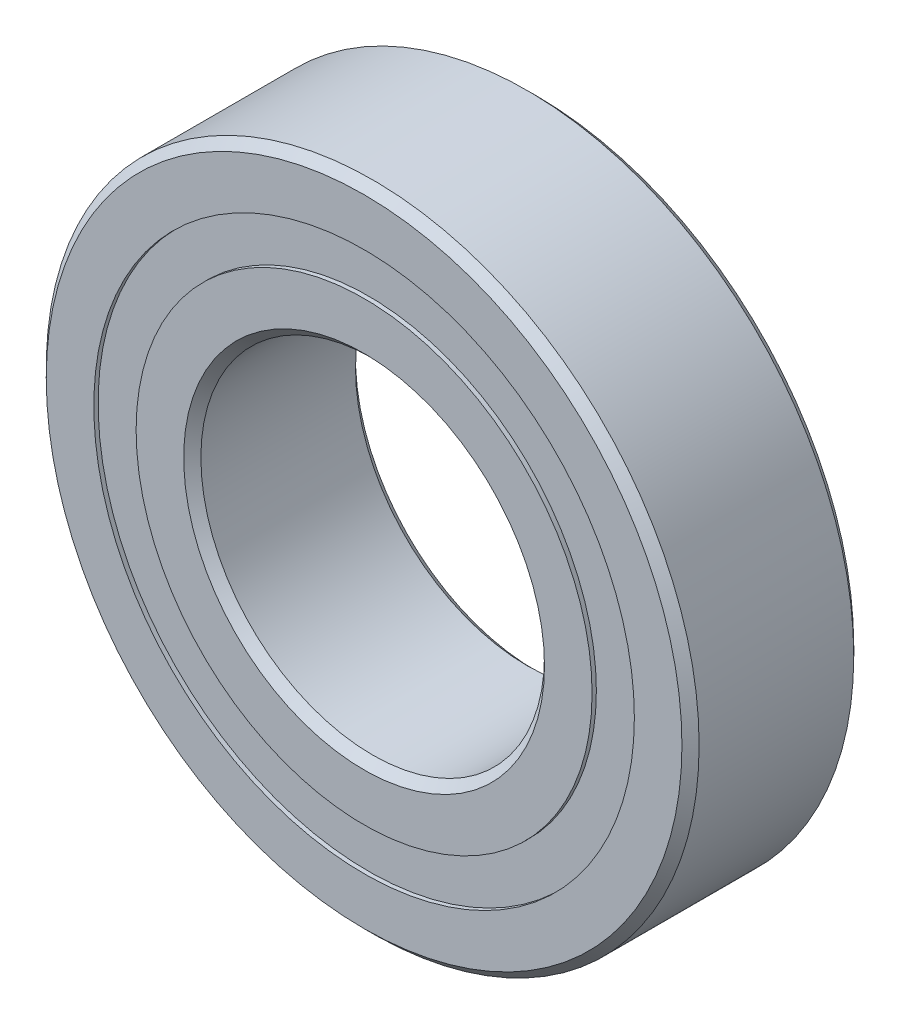
ISO-10303-21;
HEADER;
FILE_DESCRIPTION(('STEP AP214'),'2;1');
FILE_NAME('part.step','',(''),(''),'','','');
FILE_SCHEMA(('AUTOMOTIVE_DESIGN { 1 0 10303 214 1 1 1 1 }'));
ENDSEC;
DATA;
#1=APPLICATION_CONTEXT('core data for automotive mechanical design processes');
#2=APPLICATION_PROTOCOL_DEFINITION('international standard','automotive_design',2000,#1);
#3=PRODUCT_CONTEXT('',#1,'mechanical');
#4=PRODUCT('Part','Part','',(#3));
#5=PRODUCT_RELATED_PRODUCT_CATEGORY('part','',(#4));
#6=PRODUCT_DEFINITION_FORMATION('','',#4);
#7=PRODUCT_DEFINITION_CONTEXT('part definition',#1,'design');
#8=PRODUCT_DEFINITION('design','',#6,#7);
#9=PRODUCT_DEFINITION_SHAPE('','',#8);
#10=(LENGTH_UNIT() NAMED_UNIT(*) SI_UNIT(.MILLI.,.METRE.));
#11=(NAMED_UNIT(*) PLANE_ANGLE_UNIT() SI_UNIT($,.RADIAN.));
#12=(NAMED_UNIT(*) SI_UNIT($,.STERADIAN.) SOLID_ANGLE_UNIT());
#13=UNCERTAINTY_MEASURE_WITH_UNIT(LENGTH_MEASURE(1.E-05),#10,'distance_accuracy_value','');
#14=(GEOMETRIC_REPRESENTATION_CONTEXT(3) GLOBAL_UNCERTAINTY_ASSIGNED_CONTEXT((#13)) GLOBAL_UNIT_ASSIGNED_CONTEXT((#10,
#11,#12)) REPRESENTATION_CONTEXT('',''));
#15=CARTESIAN_POINT('',(0.,0.,0.));
#16=DIRECTION('',(0.,0.,1.));
#17=DIRECTION('',(1.,0.,0.));
#18=AXIS2_PLACEMENT_3D('',#15,#16,#17);
#19=CARTESIAN_POINT('',(0.,7.86538461538461,-2.375));
#20=DIRECTION('',(0.,0.,1.));
#21=DIRECTION('',(1.,0.,0.));
#22=AXIS2_PLACEMENT_3D('',#19,#20,#21);
#23=PLANE('',#22);
#24=CARTESIAN_POINT('',(0.,0.,-2.375));
#25=DIRECTION('',(0.,0.,1.));
#26=DIRECTION('',(1.,0.,0.));
#27=AXIS2_PLACEMENT_3D('',#24,#25,#26);
#28=CIRCLE('',#27,7.86538461538461);
#29=CARTESIAN_POINT('',(7.86538461538461,0.,-2.375));
#30=VERTEX_POINT('',#29);
#31=EDGE_CURVE('E55',#30,#30,#28,.T.);
#32=ORIENTED_EDGE('',*,*,#31,.F.);
#33=EDGE_LOOP('',(#32));
#34=FACE_BOUND('',#33,.T.);
#35=CARTESIAN_POINT('',(0.,0.,-2.375));
#36=DIRECTION('',(0.,0.,1.));
#37=DIRECTION('',(1.,0.,0.));
#38=AXIS2_PLACEMENT_3D('',#35,#36,#37);
#39=CIRCLE('',#38,6.63461538461539);
#40=CARTESIAN_POINT('',(6.63461538461539,0.,-2.375));
#41=VERTEX_POINT('',#40);
#42=EDGE_CURVE('E11',#41,#41,#39,.T.);
#43=ORIENTED_EDGE('',*,*,#42,.T.);
#44=EDGE_LOOP('',(#43));
#45=FACE_BOUND('',#44,.T.);
#46=ADVANCED_FACE('F41',(#34,#45),#23,.F.);
#47=CARTESIAN_POINT('',(0.,0.,2.5));
#48=DIRECTION('',(0.,0.,1.));
#49=DIRECTION('',(1.,0.,0.));
#50=AXIS2_PLACEMENT_3D('',#47,#48,#49);
#51=CYLINDRICAL_SURFACE('',#50,6.63461538461539);
#52=ORIENTED_EDGE('',*,*,#42,.F.);
#53=EDGE_LOOP('',(#52));
#54=FACE_BOUND('',#53,.T.);
#55=CARTESIAN_POINT('',(0.,0.,-1.2701441359494));
#56=DIRECTION('',(0.,0.,1.));
#57=DIRECTION('',(1.,0.,0.));
#58=AXIS2_PLACEMENT_3D('',#55,#56,#57);
#59=CIRCLE('',#58,6.63461538461539);
#60=CARTESIAN_POINT('',(6.63461538461539,0.,-1.2701441359494));
#61=VERTEX_POINT('',#60);
#62=EDGE_CURVE('E47',#61,#61,#59,.T.);
#63=ORIENTED_EDGE('',*,*,#62,.T.);
#64=EDGE_LOOP('',(#63));
#65=FACE_BOUND('',#64,.T.);
#66=ADVANCED_FACE('F64',(#54,#65),#51,.F.);
#67=CARTESIAN_POINT('',(0.,7.86538461538461,-1.2701441359494));
#68=DIRECTION('',(0.,0.,-1.));
#69=DIRECTION('',(-1.,0.,0.));
#70=AXIS2_PLACEMENT_3D('',#67,#68,#69);
#71=PLANE('',#70);
#72=ORIENTED_EDGE('',*,*,#62,.F.);
#73=EDGE_LOOP('',(#72));
#74=FACE_BOUND('',#73,.T.);
#75=CARTESIAN_POINT('',(0.,0.,-1.2701441359494));
#76=DIRECTION('',(0.,0.,1.));
#77=DIRECTION('',(1.,0.,0.));
#78=AXIS2_PLACEMENT_3D('',#75,#76,#77);
#79=CIRCLE('',#78,7.86538461538461);
#80=CARTESIAN_POINT('',(7.86538461538461,0.,-1.2701441359494));
#81=VERTEX_POINT('',#80);
#82=EDGE_CURVE('E51',#81,#81,#79,.T.);
#83=ORIENTED_EDGE('',*,*,#82,.T.);
#84=EDGE_LOOP('',(#83));
#85=FACE_BOUND('',#84,.T.);
#86=ADVANCED_FACE('F68',(#74,#85),#71,.F.);
#87=CARTESIAN_POINT('',(0.,0.,2.5));
#88=DIRECTION('',(0.,0.,1.));
#89=DIRECTION('',(1.,0.,0.));
#90=AXIS2_PLACEMENT_3D('',#87,#88,#89);
#91=CYLINDRICAL_SURFACE('',#90,7.86538461538461);
#92=ORIENTED_EDGE('',*,*,#82,.F.);
#93=EDGE_LOOP('',(#92));
#94=FACE_BOUND('',#93,.T.);
#95=ORIENTED_EDGE('',*,*,#31,.T.);
#96=EDGE_LOOP('',(#95));
#97=FACE_BOUND('',#96,.T.);
#98=ADVANCED_FACE('F61',(#94,#97),#91,.T.);
#99=CLOSED_SHELL('',(#46,#66,#86,#98));
#100=MANIFOLD_SOLID_BREP('B2',#99);
#101=CARTESIAN_POINT('',(0.,7.86538461538461,2.375));
#102=DIRECTION('',(0.,0.,-1.));
#103=DIRECTION('',(-1.,0.,0.));
#104=AXIS2_PLACEMENT_3D('',#101,#102,#103);
#105=PLANE('',#104);
#106=CARTESIAN_POINT('',(0.,0.,2.375));
#107=DIRECTION('',(0.,0.,1.));
#108=DIRECTION('',(1.,0.,0.));
#109=AXIS2_PLACEMENT_3D('',#106,#107,#108);
#110=CIRCLE('',#109,6.63461538461539);
#111=CARTESIAN_POINT('',(6.63461538461539,0.,2.375));
#112=VERTEX_POINT('',#111);
#113=EDGE_CURVE('E40',#112,#112,#110,.T.);
#114=ORIENTED_EDGE('',*,*,#113,.F.);
#115=EDGE_LOOP('',(#114));
#116=FACE_BOUND('',#115,.T.);
#117=CARTESIAN_POINT('',(0.,0.,2.375));
#118=DIRECTION('',(0.,0.,1.));
#119=DIRECTION('',(1.,0.,0.));
#120=AXIS2_PLACEMENT_3D('',#117,#118,#119);
#121=CIRCLE('',#120,7.86538461538461);
#122=CARTESIAN_POINT('',(7.86538461538461,0.,2.375));
#123=VERTEX_POINT('',#122);
#124=EDGE_CURVE('E122',#123,#123,#121,.T.);
#125=ORIENTED_EDGE('',*,*,#124,.T.);
#126=EDGE_LOOP('',(#125));
#127=FACE_BOUND('',#126,.T.);
#128=ADVANCED_FACE('F108',(#116,#127),#105,.F.);
#129=CARTESIAN_POINT('',(0.,0.,2.5));
#130=DIRECTION('',(0.,0.,1.));
#131=DIRECTION('',(1.,0.,0.));
#132=AXIS2_PLACEMENT_3D('',#129,#130,#131);
#133=CYLINDRICAL_SURFACE('',#132,6.63461538461539);
#134=CARTESIAN_POINT('',(0.,0.,1.27014413594939));
#135=DIRECTION('',(0.,0.,1.));
#136=DIRECTION('',(1.,0.,0.));
#137=AXIS2_PLACEMENT_3D('',#134,#135,#136);
#138=CIRCLE('',#137,6.63461538461539);
#139=CARTESIAN_POINT('',(6.63461538461539,0.,1.27014413594939));
#140=VERTEX_POINT('',#139);
#141=EDGE_CURVE('E114',#140,#140,#138,.T.);
#142=ORIENTED_EDGE('',*,*,#141,.F.);
#143=EDGE_LOOP('',(#142));
#144=FACE_BOUND('',#143,.T.);
#145=ORIENTED_EDGE('',*,*,#113,.T.);
#146=EDGE_LOOP('',(#145));
#147=FACE_BOUND('',#146,.T.);
#148=ADVANCED_FACE('F137',(#144,#147),#133,.F.);
#149=CARTESIAN_POINT('',(0.,7.86538461538461,1.27014413594939));
#150=DIRECTION('',(0.,0.,1.));
#151=DIRECTION('',(1.,0.,0.));
#152=AXIS2_PLACEMENT_3D('',#149,#150,#151);
#153=PLANE('',#152);
#154=CARTESIAN_POINT('',(0.,0.,1.27014413594939));
#155=DIRECTION('',(0.,0.,1.));
#156=DIRECTION('',(1.,0.,0.));
#157=AXIS2_PLACEMENT_3D('',#154,#155,#156);
#158=CIRCLE('',#157,7.86538461538461);
#159=CARTESIAN_POINT('',(7.86538461538461,0.,1.27014413594939));
#160=VERTEX_POINT('',#159);
#161=EDGE_CURVE('E118',#160,#160,#158,.T.);
#162=ORIENTED_EDGE('',*,*,#161,.F.);
#163=EDGE_LOOP('',(#162));
#164=FACE_BOUND('',#163,.T.);
#165=ORIENTED_EDGE('',*,*,#141,.T.);
#166=EDGE_LOOP('',(#165));
#167=FACE_BOUND('',#166,.T.);
#168=ADVANCED_FACE('F132',(#164,#167),#153,.F.);
#169=CARTESIAN_POINT('',(0.,0.,2.5));
#170=DIRECTION('',(0.,0.,1.));
#171=DIRECTION('',(1.,0.,0.));
#172=AXIS2_PLACEMENT_3D('',#169,#170,#171);
#173=CYLINDRICAL_SURFACE('',#172,7.86538461538461);
#174=ORIENTED_EDGE('',*,*,#124,.F.);
#175=EDGE_LOOP('',(#174));
#176=FACE_BOUND('',#175,.T.);
#177=ORIENTED_EDGE('',*,*,#161,.T.);
#178=EDGE_LOOP('',(#177));
#179=FACE_BOUND('',#178,.T.);
#180=ADVANCED_FACE('F129',(#176,#179),#173,.T.);
#181=CLOSED_SHELL('',(#128,#148,#168,#180));
#182=MANIFOLD_SOLID_BREP('B6',#181);
#183=CARTESIAN_POINT('',(-3.62499999999992,6.27868417743723,0.));
#184=DIRECTION('',(0.,0.,1.));
#185=DIRECTION('',(0.499999999999989,-0.866025403784445,0.));
#186=AXIS2_PLACEMENT_3D('',#183,#184,#185);
#187=SPHERICAL_SURFACE('',#186,1.2701441359494);
#188=CARTESIAN_POINT('',(-3.62499999999992,6.27868417743723,1.27014413594939));
#189=VERTEX_POINT('',#188);
#190=VERTEX_LOOP('',#189);
#191=FACE_BOUND('',#190,.T.);
#192=ADVANCED_FACE('F175',(#191),#187,.T.);
#193=CLOSED_SHELL('',(#192));
#194=MANIFOLD_SOLID_BREP('B35',#193);
#195=CARTESIAN_POINT('',(-6.27868417743714,3.62500000000007,0.));
#196=DIRECTION('',(0.,0.,1.));
#197=DIRECTION('',(0.866025403784433,-0.50000000000001,0.));
#198=AXIS2_PLACEMENT_3D('',#195,#196,#197);
#199=SPHERICAL_SURFACE('',#198,1.2701441359494);
#200=CARTESIAN_POINT('',(-6.27868417743714,3.62500000000007,1.27014413594939));
#201=VERTEX_POINT('',#200);
#202=VERTEX_LOOP('',#201);
#203=FACE_BOUND('',#202,.T.);
#204=ADVANCED_FACE('F195',(#203),#199,.T.);
#205=CLOSED_SHELL('',(#204));
#206=MANIFOLD_SOLID_BREP('B104',#205);
#207=CARTESIAN_POINT('',(-7.25,0.,0.));
#208=DIRECTION('',(0.,0.,1.));
#209=DIRECTION('',(1.,0.,0.));
#210=AXIS2_PLACEMENT_3D('',#207,#208,#209);
#211=SPHERICAL_SURFACE('',#210,1.2701441359494);
#212=CARTESIAN_POINT('',(-7.25,0.,1.27014413594939));
#213=VERTEX_POINT('',#212);
#214=VERTEX_LOOP('',#213);
#215=FACE_BOUND('',#214,.T.);
#216=ADVANCED_FACE('F215',(#215),#211,.T.);
#217=CLOSED_SHELL('',(#216));
#218=MANIFOLD_SOLID_BREP('B171',#217);
#219=CARTESIAN_POINT('',(-6.27868417743721,-3.62499999999994,0.));
#220=DIRECTION('',(0.,0.,1.));
#221=DIRECTION('',(0.866025403784443,0.499999999999992,0.));
#222=AXIS2_PLACEMENT_3D('',#219,#220,#221);
#223=SPHERICAL_SURFACE('',#222,1.2701441359494);
#224=CARTESIAN_POINT('',(-6.27868417743721,-3.62499999999994,1.27014413594939));
#225=VERTEX_POINT('',#224);
#226=VERTEX_LOOP('',#225);
#227=FACE_BOUND('',#226,.T.);
#228=ADVANCED_FACE('F235',(#227),#223,.T.);
#229=CLOSED_SHELL('',(#228));
#230=MANIFOLD_SOLID_BREP('B191',#229);
#231=CARTESIAN_POINT('',(-3.62500000000005,-6.27868417743715,0.));
#232=DIRECTION('',(0.,0.,1.));
#233=DIRECTION('',(0.500000000000007,0.866025403784435,0.));
#234=AXIS2_PLACEMENT_3D('',#231,#232,#233);
#235=SPHERICAL_SURFACE('',#234,1.2701441359494);
#236=CARTESIAN_POINT('',(-3.62500000000005,-6.27868417743715,1.27014413594939));
#237=VERTEX_POINT('',#236);
#238=VERTEX_LOOP('',#237);
#239=FACE_BOUND('',#238,.T.);
#240=ADVANCED_FACE('F255',(#239),#235,.T.);
#241=CLOSED_SHELL('',(#240));
#242=MANIFOLD_SOLID_BREP('B211',#241);
#243=CARTESIAN_POINT('',(0.,-7.25,0.));
#244=DIRECTION('',(0.,0.,1.));
#245=DIRECTION('',(0.,1.,0.));
#246=AXIS2_PLACEMENT_3D('',#243,#244,#245);
#247=SPHERICAL_SURFACE('',#246,1.2701441359494);
#248=CARTESIAN_POINT('',(0.,-7.25,1.27014413594939));
#249=VERTEX_POINT('',#248);
#250=VERTEX_LOOP('',#249);
#251=FACE_BOUND('',#250,.T.);
#252=ADVANCED_FACE('F275',(#251),#247,.T.);
#253=CLOSED_SHELL('',(#252));
#254=MANIFOLD_SOLID_BREP('B231',#253);
#255=CARTESIAN_POINT('',(3.62499999999996,-6.2786841774372,0.));
#256=DIRECTION('',(0.,0.,1.));
#257=DIRECTION('',(-0.499999999999995,0.866025403784442,0.));
#258=AXIS2_PLACEMENT_3D('',#255,#256,#257);
#259=SPHERICAL_SURFACE('',#258,1.2701441359494);
#260=CARTESIAN_POINT('',(3.62499999999996,-6.2786841774372,1.27014413594939));
#261=VERTEX_POINT('',#260);
#262=VERTEX_LOOP('',#261);
#263=FACE_BOUND('',#262,.T.);
#264=ADVANCED_FACE('F295',(#263),#259,.T.);
#265=CLOSED_SHELL('',(#264));
#266=MANIFOLD_SOLID_BREP('B251',#265);
#267=CARTESIAN_POINT('',(6.27868417743717,-3.62500000000003,0.));
#268=DIRECTION('',(0.,0.,1.));
#269=DIRECTION('',(-0.866025403784436,0.500000000000004,0.));
#270=AXIS2_PLACEMENT_3D('',#267,#268,#269);
#271=SPHERICAL_SURFACE('',#270,1.2701441359494);
#272=CARTESIAN_POINT('',(6.27868417743717,-3.62500000000003,1.27014413594939));
#273=VERTEX_POINT('',#272);
#274=VERTEX_LOOP('',#273);
#275=FACE_BOUND('',#274,.T.);
#276=ADVANCED_FACE('F315',(#275),#271,.T.);
#277=CLOSED_SHELL('',(#276));
#278=MANIFOLD_SOLID_BREP('B271',#277);
#279=CARTESIAN_POINT('',(7.25,0.,0.));
#280=DIRECTION('',(0.,0.,1.));
#281=DIRECTION('',(-1.,0.,0.));
#282=AXIS2_PLACEMENT_3D('',#279,#280,#281);
#283=SPHERICAL_SURFACE('',#282,1.2701441359494);
#284=CARTESIAN_POINT('',(7.25,0.,1.27014413594939));
#285=VERTEX_POINT('',#284);
#286=VERTEX_LOOP('',#285);
#287=FACE_BOUND('',#286,.T.);
#288=ADVANCED_FACE('F335',(#287),#283,.T.);
#289=CLOSED_SHELL('',(#288));
#290=MANIFOLD_SOLID_BREP('B291',#289);
#291=CARTESIAN_POINT('',(6.27868417743719,3.62499999999999,0.));
#292=DIRECTION('',(0.,0.,1.));
#293=DIRECTION('',(-0.86602540378444,-0.499999999999998,0.));
#294=AXIS2_PLACEMENT_3D('',#291,#292,#293);
#295=SPHERICAL_SURFACE('',#294,1.2701441359494);
#296=CARTESIAN_POINT('',(6.27868417743719,3.62499999999999,1.27014413594939));
#297=VERTEX_POINT('',#296);
#298=VERTEX_LOOP('',#297);
#299=FACE_BOUND('',#298,.T.);
#300=ADVANCED_FACE('F355',(#299),#295,.T.);
#301=CLOSED_SHELL('',(#300));
#302=MANIFOLD_SOLID_BREP('B311',#301);
#303=CARTESIAN_POINT('',(3.62500000000001,6.27868417743718,0.));
#304=DIRECTION('',(0.,0.,1.));
#305=DIRECTION('',(-0.500000000000001,-0.866025403784438,0.));
#306=AXIS2_PLACEMENT_3D('',#303,#304,#305);
#307=SPHERICAL_SURFACE('',#306,1.2701441359494);
#308=CARTESIAN_POINT('',(3.62500000000001,6.27868417743718,1.27014413594939));
#309=VERTEX_POINT('',#308);
#310=VERTEX_LOOP('',#309);
#311=FACE_BOUND('',#310,.T.);
#312=ADVANCED_FACE('F375',(#311),#307,.T.);
#313=CLOSED_SHELL('',(#312));
#314=MANIFOLD_SOLID_BREP('B331',#313);
#315=CARTESIAN_POINT('',(0.,7.25,0.));
#316=DIRECTION('',(0.,0.,1.));
#317=DIRECTION('',(0.,-1.,0.));
#318=AXIS2_PLACEMENT_3D('',#315,#316,#317);
#319=SPHERICAL_SURFACE('',#318,1.2701441359494);
#320=CARTESIAN_POINT('',(0.,7.25,1.27014413594939));
#321=VERTEX_POINT('',#320);
#322=VERTEX_LOOP('',#321);
#323=FACE_BOUND('',#322,.T.);
#324=ADVANCED_FACE('F397',(#323),#319,.T.);
#325=CLOSED_SHELL('',(#324));
#326=MANIFOLD_SOLID_BREP('B351',#325);
#327=CARTESIAN_POINT('',(0.,6.63461538461539,2.5));
#328=DIRECTION('',(0.,0.,-1.));
#329=DIRECTION('',(-1.,0.,0.));
#330=AXIS2_PLACEMENT_3D('',#327,#328,#329);
#331=PLANE('',#330);
#332=CARTESIAN_POINT('',(0.,0.,2.5));
#333=DIRECTION('',(0.,0.,1.));
#334=DIRECTION('',(1.,0.,0.));
#335=AXIS2_PLACEMENT_3D('',#332,#333,#334);
#336=CIRCLE('',#335,5.25);
#337=CARTESIAN_POINT('',(5.25,0.,2.5));
#338=VERTEX_POINT('',#337);
#339=EDGE_CURVE('E444',#338,#338,#336,.T.);
#340=ORIENTED_EDGE('',*,*,#339,.F.);
#341=EDGE_LOOP('',(#340));
#342=FACE_BOUND('',#341,.T.);
#343=CARTESIAN_POINT('',(0.,0.,2.5));
#344=DIRECTION('',(0.,0.,1.));
#345=DIRECTION('',(1.,0.,0.));
#346=AXIS2_PLACEMENT_3D('',#343,#344,#345);
#347=CIRCLE('',#346,6.63461538461539);
#348=CARTESIAN_POINT('',(6.63461538461539,0.,2.5));
#349=VERTEX_POINT('',#348);
#350=EDGE_CURVE('E396',#349,#349,#347,.T.);
#351=ORIENTED_EDGE('',*,*,#350,.T.);
#352=EDGE_LOOP('',(#351));
#353=FACE_BOUND('',#352,.T.);
#354=ADVANCED_FACE('F416',(#342,#353),#331,.F.);
#355=CARTESIAN_POINT('',(0.,0.,2.5));
#356=DIRECTION('',(0.,0.,1.));
#357=DIRECTION('',(1.,0.,0.));
#358=AXIS2_PLACEMENT_3D('',#355,#356,#357);
#359=CYLINDRICAL_SURFACE('',#358,6.63461538461539);
#360=ORIENTED_EDGE('',*,*,#350,.F.);
#361=EDGE_LOOP('',(#360));
#362=FACE_BOUND('',#361,.T.);
#363=CARTESIAN_POINT('',(0.,0.,1.11111111111111));
#364=DIRECTION('',(0.,0.,1.));
#365=DIRECTION('',(1.,0.,0.));
#366=AXIS2_PLACEMENT_3D('',#363,#364,#365);
#367=CIRCLE('',#366,6.63461538461539);
#368=CARTESIAN_POINT('',(6.63461538461539,0.,1.11111111111111));
#369=VERTEX_POINT('',#368);
#370=EDGE_CURVE('E422',#369,#369,#367,.T.);
#371=ORIENTED_EDGE('',*,*,#370,.T.);
#372=EDGE_LOOP('',(#371));
#373=FACE_BOUND('',#372,.T.);
#374=ADVANCED_FACE('F451',(#362,#373),#359,.T.);
#375=CARTESIAN_POINT('',(0.,0.,0.));
#376=DIRECTION('',(0.,0.,1.));
#377=DIRECTION('',(1.,0.,0.));
#378=AXIS2_PLACEMENT_3D('',#375,#376,#377);
#379=TOROIDAL_SURFACE('',#378,7.24999999999999,1.27014413594939);
#380=ORIENTED_EDGE('',*,*,#370,.F.);
#381=EDGE_LOOP('',(#380));
#382=FACE_BOUND('',#381,.T.);
#383=CARTESIAN_POINT('',(0.,0.,-1.11111111111111));
#384=DIRECTION('',(0.,0.,1.));
#385=DIRECTION('',(1.,0.,0.));
#386=AXIS2_PLACEMENT_3D('',#383,#384,#385);
#387=CIRCLE('',#386,6.63461538461538);
#388=CARTESIAN_POINT('',(6.63461538461538,0.,-1.11111111111111));
#389=VERTEX_POINT('',#388);
#390=EDGE_CURVE('E426',#389,#389,#387,.T.);
#391=ORIENTED_EDGE('',*,*,#390,.T.);
#392=EDGE_LOOP('',(#391));
#393=FACE_BOUND('',#392,.T.);
#394=ADVANCED_FACE('F455',(#382,#393),#379,.F.);
#395=CARTESIAN_POINT('',(0.,0.,2.5));
#396=DIRECTION('',(0.,0.,1.));
#397=DIRECTION('',(1.,0.,0.));
#398=AXIS2_PLACEMENT_3D('',#395,#396,#397);
#399=CYLINDRICAL_SURFACE('',#398,6.63461538461538);
#400=ORIENTED_EDGE('',*,*,#390,.F.);
#401=EDGE_LOOP('',(#400));
#402=FACE_BOUND('',#401,.T.);
#403=CARTESIAN_POINT('',(0.,0.,-2.5));
#404=DIRECTION('',(0.,0.,1.));
#405=DIRECTION('',(1.,0.,0.));
#406=AXIS2_PLACEMENT_3D('',#403,#404,#405);
#407=CIRCLE('',#406,6.63461538461539);
#408=CARTESIAN_POINT('',(6.63461538461539,0.,-2.5));
#409=VERTEX_POINT('',#408);
#410=EDGE_CURVE('E430',#409,#409,#407,.T.);
#411=ORIENTED_EDGE('',*,*,#410,.T.);
#412=EDGE_LOOP('',(#411));
#413=FACE_BOUND('',#412,.T.);
#414=ADVANCED_FACE('F460',(#402,#413),#399,.T.);
#415=CARTESIAN_POINT('',(0.,5.25,-2.5));
#416=DIRECTION('',(0.,0.,1.));
#417=DIRECTION('',(1.,0.,0.));
#418=AXIS2_PLACEMENT_3D('',#415,#416,#417);
#419=PLANE('',#418);
#420=ORIENTED_EDGE('',*,*,#410,.F.);
#421=EDGE_LOOP('',(#420));
#422=FACE_BOUND('',#421,.T.);
#423=CARTESIAN_POINT('',(0.,0.,-2.5));
#424=DIRECTION('',(0.,0.,1.));
#425=DIRECTION('',(1.,0.,0.));
#426=AXIS2_PLACEMENT_3D('',#423,#424,#425);
#427=CIRCLE('',#426,5.25);
#428=CARTESIAN_POINT('',(5.25,0.,-2.5));
#429=VERTEX_POINT('',#428);
#430=EDGE_CURVE('E435',#429,#429,#427,.T.);
#431=ORIENTED_EDGE('',*,*,#430,.T.);
#432=EDGE_LOOP('',(#431));
#433=FACE_BOUND('',#432,.T.);
#434=ADVANCED_FACE('F466',(#422,#433),#419,.F.);
#435=CARTESIAN_POINT('',(0.,0.,-2.25));
#436=DIRECTION('',(0.,0.,-1.));
#437=DIRECTION('',(-1.,0.,0.));
#438=AXIS2_PLACEMENT_3D('',#435,#436,#437);
#439=CONICAL_SURFACE('',#438,5.,0.785398163397448);
#440=ORIENTED_EDGE('',*,*,#430,.F.);
#441=EDGE_LOOP('',(#440));
#442=FACE_BOUND('',#441,.T.);
#443=CARTESIAN_POINT('',(0.,0.,-2.25));
#444=DIRECTION('',(0.,0.,1.));
#445=DIRECTION('',(1.,0.,0.));
#446=AXIS2_PLACEMENT_3D('',#443,#444,#445);
#447=CIRCLE('',#446,5.);
#448=CARTESIAN_POINT('',(5.,0.,-2.25));
#449=VERTEX_POINT('',#448);
#450=EDGE_CURVE('E438',#449,#449,#447,.T.);
#451=ORIENTED_EDGE('',*,*,#450,.T.);
#452=EDGE_LOOP('',(#451));
#453=FACE_BOUND('',#452,.T.);
#454=ADVANCED_FACE('F470',(#442,#453),#439,.F.);
#455=CARTESIAN_POINT('',(0.,0.,2.5));
#456=DIRECTION('',(0.,0.,1.));
#457=DIRECTION('',(1.,0.,0.));
#458=AXIS2_PLACEMENT_3D('',#455,#456,#457);
#459=CYLINDRICAL_SURFACE('',#458,5.);
#460=ORIENTED_EDGE('',*,*,#450,.F.);
#461=EDGE_LOOP('',(#460));
#462=FACE_BOUND('',#461,.T.);
#463=CARTESIAN_POINT('',(0.,0.,2.25));
#464=DIRECTION('',(0.,0.,1.));
#465=DIRECTION('',(1.,0.,0.));
#466=AXIS2_PLACEMENT_3D('',#463,#464,#465);
#467=CIRCLE('',#466,5.);
#468=CARTESIAN_POINT('',(5.,0.,2.25));
#469=VERTEX_POINT('',#468);
#470=EDGE_CURVE('E441',#469,#469,#467,.T.);
#471=ORIENTED_EDGE('',*,*,#470,.T.);
#472=EDGE_LOOP('',(#471));
#473=FACE_BOUND('',#472,.T.);
#474=ADVANCED_FACE('F474',(#462,#473),#459,.F.);
#475=CARTESIAN_POINT('',(0.,0.,2.5));
#476=DIRECTION('',(0.,0.,1.));
#477=DIRECTION('',(1.,0.,0.));
#478=AXIS2_PLACEMENT_3D('',#475,#476,#477);
#479=CONICAL_SURFACE('',#478,5.25,0.785398163397449);
#480=ORIENTED_EDGE('',*,*,#470,.F.);
#481=EDGE_LOOP('',(#480));
#482=FACE_BOUND('',#481,.T.);
#483=ORIENTED_EDGE('',*,*,#339,.T.);
#484=EDGE_LOOP('',(#483));
#485=FACE_BOUND('',#484,.T.);
#486=ADVANCED_FACE('F448',(#482,#485),#479,.F.);
#487=CLOSED_SHELL('',(#354,#374,#394,#414,#434,#454,#474,#486));
#488=MANIFOLD_SOLID_BREP('B371',#487);
#489=CARTESIAN_POINT('',(0.,0.,2.25));
#490=DIRECTION('',(0.,0.,-1.));
#491=DIRECTION('',(-1.,0.,0.));
#492=AXIS2_PLACEMENT_3D('',#489,#490,#491);
#493=CONICAL_SURFACE('',#492,9.5,0.785398163397449);
#494=CARTESIAN_POINT('',(0.,0.,2.5));
#495=DIRECTION('',(0.,0.,1.));
#496=DIRECTION('',(1.,0.,0.));
#497=AXIS2_PLACEMENT_3D('',#494,#495,#496);
#498=CIRCLE('',#497,9.25);
#499=CARTESIAN_POINT('',(9.25,0.,2.5));
#500=VERTEX_POINT('',#499);
#501=EDGE_CURVE('E565',#500,#500,#498,.T.);
#502=ORIENTED_EDGE('',*,*,#501,.F.);
#503=EDGE_LOOP('',(#502));
#504=FACE_BOUND('',#503,.T.);
#505=CARTESIAN_POINT('',(0.,0.,2.25));
#506=DIRECTION('',(0.,0.,1.));
#507=DIRECTION('',(1.,0.,0.));
#508=AXIS2_PLACEMENT_3D('',#505,#506,#507);
#509=CIRCLE('',#508,9.5);
#510=CARTESIAN_POINT('',(9.5,0.,2.25));
#511=VERTEX_POINT('',#510);
#512=EDGE_CURVE('E415',#511,#511,#509,.T.);
#513=ORIENTED_EDGE('',*,*,#512,.T.);
#514=EDGE_LOOP('',(#513));
#515=FACE_BOUND('',#514,.T.);
#516=ADVANCED_FACE('F537',(#504,#515),#493,.T.);
#517=CARTESIAN_POINT('',(0.,0.,2.5));
#518=DIRECTION('',(0.,0.,1.));
#519=DIRECTION('',(1.,0.,0.));
#520=AXIS2_PLACEMENT_3D('',#517,#518,#519);
#521=CYLINDRICAL_SURFACE('',#520,9.5);
#522=ORIENTED_EDGE('',*,*,#512,.F.);
#523=EDGE_LOOP('',(#522));
#524=FACE_BOUND('',#523,.T.);
#525=CARTESIAN_POINT('',(0.,0.,-2.25));
#526=DIRECTION('',(0.,0.,1.));
#527=DIRECTION('',(1.,0.,0.));
#528=AXIS2_PLACEMENT_3D('',#525,#526,#527);
#529=CIRCLE('',#528,9.5);
#530=CARTESIAN_POINT('',(9.5,0.,-2.25));
#531=VERTEX_POINT('',#530);
#532=EDGE_CURVE('E543',#531,#531,#529,.T.);
#533=ORIENTED_EDGE('',*,*,#532,.T.);
#534=EDGE_LOOP('',(#533));
#535=FACE_BOUND('',#534,.T.);
#536=ADVANCED_FACE('F572',(#524,#535),#521,.T.);
#537=CARTESIAN_POINT('',(0.,0.,-2.5));
#538=DIRECTION('',(0.,0.,1.));
#539=DIRECTION('',(1.,0.,0.));
#540=AXIS2_PLACEMENT_3D('',#537,#538,#539);
#541=CONICAL_SURFACE('',#540,9.25,0.785398163397448);
#542=ORIENTED_EDGE('',*,*,#532,.F.);
#543=EDGE_LOOP('',(#542));
#544=FACE_BOUND('',#543,.T.);
#545=CARTESIAN_POINT('',(0.,0.,-2.5));
#546=DIRECTION('',(0.,0.,1.));
#547=DIRECTION('',(1.,0.,0.));
#548=AXIS2_PLACEMENT_3D('',#545,#546,#547);
#549=CIRCLE('',#548,9.25);
#550=CARTESIAN_POINT('',(9.25,0.,-2.5));
#551=VERTEX_POINT('',#550);
#552=EDGE_CURVE('E547',#551,#551,#549,.T.);
#553=ORIENTED_EDGE('',*,*,#552,.T.);
#554=EDGE_LOOP('',(#553));
#555=FACE_BOUND('',#554,.T.);
#556=ADVANCED_FACE('F576',(#544,#555),#541,.T.);
#557=CARTESIAN_POINT('',(0.,9.25,-2.5));
#558=DIRECTION('',(0.,0.,1.));
#559=DIRECTION('',(1.,0.,0.));
#560=AXIS2_PLACEMENT_3D('',#557,#558,#559);
#561=PLANE('',#560);
#562=ORIENTED_EDGE('',*,*,#552,.F.);
#563=EDGE_LOOP('',(#562));
#564=FACE_BOUND('',#563,.T.);
#565=CARTESIAN_POINT('',(0.,0.,-2.5));
#566=DIRECTION('',(0.,0.,1.));
#567=DIRECTION('',(1.,0.,0.));
#568=AXIS2_PLACEMENT_3D('',#565,#566,#567);
#569=CIRCLE('',#568,7.86538461538461);
#570=CARTESIAN_POINT('',(7.86538461538461,0.,-2.5));
#571=VERTEX_POINT('',#570);
#572=EDGE_CURVE('E551',#571,#571,#569,.T.);
#573=ORIENTED_EDGE('',*,*,#572,.T.);
#574=EDGE_LOOP('',(#573));
#575=FACE_BOUND('',#574,.T.);
#576=ADVANCED_FACE('F581',(#564,#575),#561,.F.);
#577=CARTESIAN_POINT('',(0.,0.,2.5));
#578=DIRECTION('',(0.,0.,1.));
#579=DIRECTION('',(1.,0.,0.));
#580=AXIS2_PLACEMENT_3D('',#577,#578,#579);
#581=CYLINDRICAL_SURFACE('',#580,7.86538461538461);
#582=ORIENTED_EDGE('',*,*,#572,.F.);
#583=EDGE_LOOP('',(#582));
#584=FACE_BOUND('',#583,.T.);
#585=CARTESIAN_POINT('',(0.,0.,-1.11111111111111));
#586=DIRECTION('',(0.,0.,1.));
#587=DIRECTION('',(1.,0.,0.));
#588=AXIS2_PLACEMENT_3D('',#585,#586,#587);
#589=CIRCLE('',#588,7.86538461538461);
#590=CARTESIAN_POINT('',(7.86538461538461,0.,-1.11111111111111));
#591=VERTEX_POINT('',#590);
#592=EDGE_CURVE('E556',#591,#591,#589,.T.);
#593=ORIENTED_EDGE('',*,*,#592,.T.);
#594=EDGE_LOOP('',(#593));
#595=FACE_BOUND('',#594,.T.);
#596=ADVANCED_FACE('F587',(#584,#595),#581,.F.);
#597=CARTESIAN_POINT('',(0.,0.,0.));
#598=DIRECTION('',(0.,0.,1.));
#599=DIRECTION('',(1.,0.,0.));
#600=AXIS2_PLACEMENT_3D('',#597,#598,#599);
#601=TOROIDAL_SURFACE('',#600,7.25,1.2701441359494);
#602=ORIENTED_EDGE('',*,*,#592,.F.);
#603=EDGE_LOOP('',(#602));
#604=FACE_BOUND('',#603,.T.);
#605=CARTESIAN_POINT('',(0.,0.,1.11111111111111));
#606=DIRECTION('',(0.,0.,1.));
#607=DIRECTION('',(1.,0.,0.));
#608=AXIS2_PLACEMENT_3D('',#605,#606,#607);
#609=CIRCLE('',#608,7.86538461538461);
#610=CARTESIAN_POINT('',(7.86538461538461,0.,1.11111111111111));
#611=VERTEX_POINT('',#610);
#612=EDGE_CURVE('E559',#611,#611,#609,.T.);
#613=ORIENTED_EDGE('',*,*,#612,.T.);
#614=EDGE_LOOP('',(#613));
#615=FACE_BOUND('',#614,.T.);
#616=ADVANCED_FACE('F591',(#604,#615),#601,.F.);
#617=CARTESIAN_POINT('',(0.,0.,2.5));
#618=DIRECTION('',(0.,0.,1.));
#619=DIRECTION('',(1.,0.,0.));
#620=AXIS2_PLACEMENT_3D('',#617,#618,#619);
#621=CYLINDRICAL_SURFACE('',#620,7.86538461538461);
#622=ORIENTED_EDGE('',*,*,#612,.F.);
#623=EDGE_LOOP('',(#622));
#624=FACE_BOUND('',#623,.T.);
#625=CARTESIAN_POINT('',(0.,0.,2.5));
#626=DIRECTION('',(0.,0.,1.));
#627=DIRECTION('',(1.,0.,0.));
#628=AXIS2_PLACEMENT_3D('',#625,#626,#627);
#629=CIRCLE('',#628,7.86538461538461);
#630=CARTESIAN_POINT('',(7.86538461538461,0.,2.5));
#631=VERTEX_POINT('',#630);
#632=EDGE_CURVE('E562',#631,#631,#629,.T.);
#633=ORIENTED_EDGE('',*,*,#632,.T.);
#634=EDGE_LOOP('',(#633));
#635=FACE_BOUND('',#634,.T.);
#636=ADVANCED_FACE('F595',(#624,#635),#621,.F.);
#637=CARTESIAN_POINT('',(0.,9.25,2.5));
#638=DIRECTION('',(0.,0.,-1.));
#639=DIRECTION('',(-1.,0.,0.));
#640=AXIS2_PLACEMENT_3D('',#637,#638,#639);
#641=PLANE('',#640);
#642=ORIENTED_EDGE('',*,*,#632,.F.);
#643=EDGE_LOOP('',(#642));
#644=FACE_BOUND('',#643,.T.);
#645=ORIENTED_EDGE('',*,*,#501,.T.);
#646=EDGE_LOOP('',(#645));
#647=FACE_BOUND('',#646,.T.);
#648=ADVANCED_FACE('F569',(#644,#647),#641,.F.);
#649=CLOSED_SHELL('',(#516,#536,#556,#576,#596,#616,#636,#648));
#650=MANIFOLD_SOLID_BREP('B391',#649);
#651=ADVANCED_BREP_SHAPE_REPRESENTATION('',(#18,#100,#182,#194,#206,#218,#230,#242,#254,#266,
#278,#290,#302,#314,#326,#488,#650),#14);
#652=SHAPE_DEFINITION_REPRESENTATION(#9,#651);
ENDSEC;
END-ISO-10303-21;
